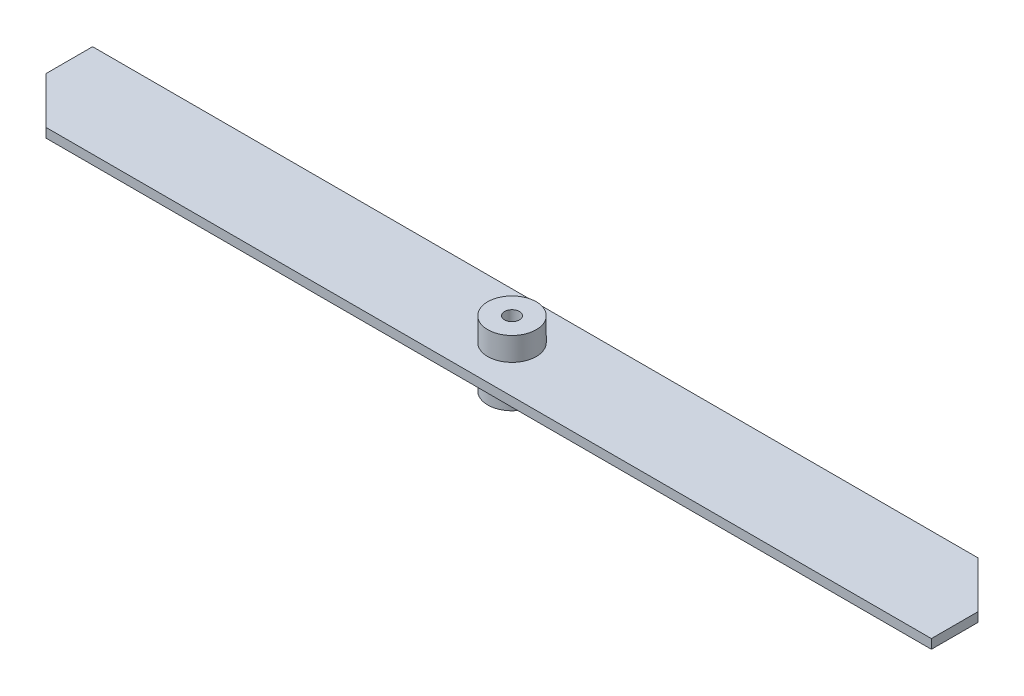
ISO-10303-21;
HEADER;
FILE_DESCRIPTION(('STEP AP214'),'2;1');
FILE_NAME('part.step','',(''),(''),'','','');
FILE_SCHEMA(('AUTOMOTIVE_DESIGN { 1 0 10303 214 1 1 1 1 }'));
ENDSEC;
DATA;
#1=APPLICATION_CONTEXT('core data for automotive mechanical design processes');
#2=APPLICATION_PROTOCOL_DEFINITION('international standard','automotive_design',2000,#1);
#3=PRODUCT_CONTEXT('',#1,'mechanical');
#4=PRODUCT('Part','Part','',(#3));
#5=PRODUCT_RELATED_PRODUCT_CATEGORY('part','',(#4));
#6=PRODUCT_DEFINITION_FORMATION('','',#4);
#7=PRODUCT_DEFINITION_CONTEXT('part definition',#1,'design');
#8=PRODUCT_DEFINITION('design','',#6,#7);
#9=PRODUCT_DEFINITION_SHAPE('','',#8);
#10=(LENGTH_UNIT() NAMED_UNIT(*) SI_UNIT(.MILLI.,.METRE.));
#11=(NAMED_UNIT(*) PLANE_ANGLE_UNIT() SI_UNIT($,.RADIAN.));
#12=(NAMED_UNIT(*) SI_UNIT($,.STERADIAN.) SOLID_ANGLE_UNIT());
#13=UNCERTAINTY_MEASURE_WITH_UNIT(LENGTH_MEASURE(1.E-05),#10,'distance_accuracy_value','');
#14=(GEOMETRIC_REPRESENTATION_CONTEXT(3) GLOBAL_UNCERTAINTY_ASSIGNED_CONTEXT((#13)) GLOBAL_UNIT_ASSIGNED_CONTEXT((#10,
#11,#12)) REPRESENTATION_CONTEXT('',''));
#15=CARTESIAN_POINT('',(0.,0.,0.));
#16=DIRECTION('',(0.,0.,1.));
#17=DIRECTION('',(1.,0.,0.));
#18=AXIS2_PLACEMENT_3D('',#15,#16,#17);
#19=CARTESIAN_POINT('',(0.,2.,0.));
#20=DIRECTION('',(0.,1.,0.));
#21=DIRECTION('',(0.,0.,1.));
#22=AXIS2_PLACEMENT_3D('',#19,#20,#21);
#23=PLANE('',#22);
#24=CARTESIAN_POINT('',(0.,2.,0.));
#25=DIRECTION('',(0.,1.,0.));
#26=DIRECTION('',(0.,0.,1.));
#27=AXIS2_PLACEMENT_3D('',#24,#25,#26);
#28=CIRCLE('',#27,5.2);
#29=CARTESIAN_POINT('',(0.,2.,5.2));
#30=VERTEX_POINT('',#29);
#31=EDGE_CURVE('E123',#30,#30,#28,.F.);
#32=ORIENTED_EDGE('',*,*,#31,.T.);
#33=EDGE_LOOP('',(#32));
#34=FACE_BOUND('',#33,.T.);
#35=DIRECTION('',(-1.,0.,0.));
#36=VECTOR('',#35,1.);
#37=CARTESIAN_POINT('',(-100.,2.,-10.));
#38=LINE('',#37,#36);
#39=CARTESIAN_POINT('',(90.,2.,-10.));
#40=VERTEX_POINT('',#39);
#41=CARTESIAN_POINT('',(-100.,2.,-10.));
#42=VERTEX_POINT('',#41);
#43=EDGE_CURVE('E130',#40,#42,#38,.T.);
#44=ORIENTED_EDGE('',*,*,#43,.T.);
#45=DIRECTION('',(0.,0.,1.));
#46=VECTOR('',#45,1.);
#47=CARTESIAN_POINT('',(-100.,2.,0.));
#48=LINE('',#47,#46);
#49=CARTESIAN_POINT('',(-100.,2.,0.));
#50=VERTEX_POINT('',#49);
#51=EDGE_CURVE('E89',#42,#50,#48,.T.);
#52=ORIENTED_EDGE('',*,*,#51,.T.);
#53=DIRECTION('',(0.707106781186547,0.,0.707106781186548));
#54=VECTOR('',#53,1.);
#55=CARTESIAN_POINT('',(-90.,2.,10.));
#56=LINE('',#55,#54);
#57=CARTESIAN_POINT('',(-90.,2.,10.));
#58=VERTEX_POINT('',#57);
#59=EDGE_CURVE('E101',#50,#58,#56,.T.);
#60=ORIENTED_EDGE('',*,*,#59,.T.);
#61=DIRECTION('',(1.,0.,0.));
#62=VECTOR('',#61,1.);
#63=CARTESIAN_POINT('',(-90.,2.,10.));
#64=LINE('',#63,#62);
#65=CARTESIAN_POINT('',(100.,2.,10.));
#66=VERTEX_POINT('',#65);
#67=EDGE_CURVE('E96',#58,#66,#64,.T.);
#68=ORIENTED_EDGE('',*,*,#67,.T.);
#69=DIRECTION('',(0.,0.,-1.));
#70=VECTOR('',#69,1.);
#71=CARTESIAN_POINT('',(100.,2.,10.));
#72=LINE('',#71,#70);
#73=CARTESIAN_POINT('',(100.,2.,0.));
#74=VERTEX_POINT('',#73);
#75=EDGE_CURVE('E99',#66,#74,#72,.T.);
#76=ORIENTED_EDGE('',*,*,#75,.T.);
#77=DIRECTION('',(-0.707106781186547,0.,-0.707106781186548));
#78=VECTOR('',#77,1.);
#79=CARTESIAN_POINT('',(90.,2.,-10.));
#80=LINE('',#79,#78);
#81=EDGE_CURVE('E51',#74,#40,#80,.T.);
#82=ORIENTED_EDGE('',*,*,#81,.T.);
#83=EDGE_LOOP('',(#44,#52,#60,#68,#76,#82));
#84=FACE_BOUND('',#83,.T.);
#85=ADVANCED_FACE('F34',(#34,#84),#23,.T.);
#86=CARTESIAN_POINT('',(0.,0.,0.));
#87=DIRECTION('',(0.,1.,0.));
#88=DIRECTION('',(0.,0.,1.));
#89=AXIS2_PLACEMENT_3D('',#86,#87,#88);
#90=PLANE('',#89);
#91=CARTESIAN_POINT('',(0.,0.,0.));
#92=DIRECTION('',(0.,1.,0.));
#93=DIRECTION('',(0.,0.,1.));
#94=AXIS2_PLACEMENT_3D('',#91,#92,#93);
#95=CIRCLE('',#94,5.2);
#96=CARTESIAN_POINT('',(0.,0.,5.2));
#97=VERTEX_POINT('',#96);
#98=EDGE_CURVE('E11',#97,#97,#95,.F.);
#99=ORIENTED_EDGE('',*,*,#98,.F.);
#100=EDGE_LOOP('',(#99));
#101=FACE_BOUND('',#100,.T.);
#102=DIRECTION('',(-1.,0.,0.));
#103=VECTOR('',#102,1.);
#104=CARTESIAN_POINT('',(-100.,0.,-10.));
#105=LINE('',#104,#103);
#106=CARTESIAN_POINT('',(90.,0.,-10.));
#107=VERTEX_POINT('',#106);
#108=CARTESIAN_POINT('',(-100.,0.,-10.));
#109=VERTEX_POINT('',#108);
#110=EDGE_CURVE('E119',#107,#109,#105,.T.);
#111=ORIENTED_EDGE('',*,*,#110,.F.);
#112=DIRECTION('',(-0.707106781186547,0.,-0.707106781186548));
#113=VECTOR('',#112,1.);
#114=CARTESIAN_POINT('',(90.,0.,-10.));
#115=LINE('',#114,#113);
#116=CARTESIAN_POINT('',(100.,0.,0.));
#117=VERTEX_POINT('',#116);
#118=EDGE_CURVE('E80',#117,#107,#115,.T.);
#119=ORIENTED_EDGE('',*,*,#118,.F.);
#120=DIRECTION('',(0.,0.,-1.));
#121=VECTOR('',#120,1.);
#122=CARTESIAN_POINT('',(100.,0.,10.));
#123=LINE('',#122,#121);
#124=CARTESIAN_POINT('',(100.,0.,10.));
#125=VERTEX_POINT('',#124);
#126=EDGE_CURVE('E74',#125,#117,#123,.T.);
#127=ORIENTED_EDGE('',*,*,#126,.F.);
#128=DIRECTION('',(1.,0.,0.));
#129=VECTOR('',#128,1.);
#130=CARTESIAN_POINT('',(-90.,0.,10.));
#131=LINE('',#130,#129);
#132=CARTESIAN_POINT('',(-90.,0.,10.));
#133=VERTEX_POINT('',#132);
#134=EDGE_CURVE('E109',#133,#125,#131,.T.);
#135=ORIENTED_EDGE('',*,*,#134,.F.);
#136=DIRECTION('',(0.707106781186547,0.,0.707106781186548));
#137=VECTOR('',#136,1.);
#138=CARTESIAN_POINT('',(-90.,0.,10.));
#139=LINE('',#138,#137);
#140=CARTESIAN_POINT('',(-100.,0.,0.));
#141=VERTEX_POINT('',#140);
#142=EDGE_CURVE('E125',#141,#133,#139,.T.);
#143=ORIENTED_EDGE('',*,*,#142,.F.);
#144=DIRECTION('',(0.,0.,1.));
#145=VECTOR('',#144,1.);
#146=CARTESIAN_POINT('',(-100.,0.,0.));
#147=LINE('',#146,#145);
#148=EDGE_CURVE('E122',#109,#141,#147,.T.);
#149=ORIENTED_EDGE('',*,*,#148,.F.);
#150=EDGE_LOOP('',(#111,#119,#127,#135,#143,#149));
#151=FACE_BOUND('',#150,.T.);
#152=ADVANCED_FACE('F142',(#101,#151),#90,.F.);
#153=CARTESIAN_POINT('',(-100.,2.,-10.));
#154=DIRECTION('',(0.,0.,1.));
#155=DIRECTION('',(1.,0.,0.));
#156=AXIS2_PLACEMENT_3D('',#153,#154,#155);
#157=PLANE('',#156);
#158=ORIENTED_EDGE('',*,*,#110,.T.);
#159=DIRECTION('',(0.,-1.,0.));
#160=VECTOR('',#159,1.);
#161=CARTESIAN_POINT('',(-100.,2.,-10.));
#162=LINE('',#161,#160);
#163=EDGE_CURVE('E43',#42,#109,#162,.T.);
#164=ORIENTED_EDGE('',*,*,#163,.F.);
#165=ORIENTED_EDGE('',*,*,#43,.F.);
#166=DIRECTION('',(0.,-1.,0.));
#167=VECTOR('',#166,1.);
#168=CARTESIAN_POINT('',(90.,2.,-10.));
#169=LINE('',#168,#167);
#170=EDGE_CURVE('E115',#40,#107,#169,.T.);
#171=ORIENTED_EDGE('',*,*,#170,.T.);
#172=EDGE_LOOP('',(#158,#164,#165,#171));
#173=FACE_BOUND('',#172,.T.);
#174=ADVANCED_FACE('F36',(#173),#157,.F.);
#175=CARTESIAN_POINT('',(-100.,2.,0.));
#176=DIRECTION('',(1.,0.,0.));
#177=DIRECTION('',(0.,0.,-1.));
#178=AXIS2_PLACEMENT_3D('',#175,#176,#177);
#179=PLANE('',#178);
#180=ORIENTED_EDGE('',*,*,#148,.T.);
#181=DIRECTION('',(0.,-1.,0.));
#182=VECTOR('',#181,1.);
#183=CARTESIAN_POINT('',(-100.,2.,0.));
#184=LINE('',#183,#182);
#185=EDGE_CURVE('E134',#50,#141,#184,.T.);
#186=ORIENTED_EDGE('',*,*,#185,.F.);
#187=ORIENTED_EDGE('',*,*,#51,.F.);
#188=ORIENTED_EDGE('',*,*,#163,.T.);
#189=EDGE_LOOP('',(#180,#186,#187,#188));
#190=FACE_BOUND('',#189,.T.);
#191=ADVANCED_FACE('F137',(#190),#179,.F.);
#192=CARTESIAN_POINT('',(-90.,2.,10.));
#193=DIRECTION('',(0.707106781186548,0.,-0.707106781186547));
#194=DIRECTION('',(-0.707106781186547,0.,-0.707106781186548));
#195=AXIS2_PLACEMENT_3D('',#192,#193,#194);
#196=PLANE('',#195);
#197=ORIENTED_EDGE('',*,*,#142,.T.);
#198=DIRECTION('',(0.,-1.,0.));
#199=VECTOR('',#198,1.);
#200=CARTESIAN_POINT('',(-90.,2.,10.));
#201=LINE('',#200,#199);
#202=EDGE_CURVE('E110',#58,#133,#201,.T.);
#203=ORIENTED_EDGE('',*,*,#202,.F.);
#204=ORIENTED_EDGE('',*,*,#59,.F.);
#205=ORIENTED_EDGE('',*,*,#185,.T.);
#206=EDGE_LOOP('',(#197,#203,#204,#205));
#207=FACE_BOUND('',#206,.T.);
#208=ADVANCED_FACE('F145',(#207),#196,.F.);
#209=CARTESIAN_POINT('',(-90.,2.,10.));
#210=DIRECTION('',(0.,0.,-1.));
#211=DIRECTION('',(-1.,0.,0.));
#212=AXIS2_PLACEMENT_3D('',#209,#210,#211);
#213=PLANE('',#212);
#214=ORIENTED_EDGE('',*,*,#134,.T.);
#215=DIRECTION('',(0.,-1.,0.));
#216=VECTOR('',#215,1.);
#217=CARTESIAN_POINT('',(100.,2.,10.));
#218=LINE('',#217,#216);
#219=EDGE_CURVE('E106',#66,#125,#218,.T.);
#220=ORIENTED_EDGE('',*,*,#219,.F.);
#221=ORIENTED_EDGE('',*,*,#67,.F.);
#222=ORIENTED_EDGE('',*,*,#202,.T.);
#223=EDGE_LOOP('',(#214,#220,#221,#222));
#224=FACE_BOUND('',#223,.T.);
#225=ADVANCED_FACE('F107',(#224),#213,.F.);
#226=CARTESIAN_POINT('',(100.,2.,10.));
#227=DIRECTION('',(-1.,0.,0.));
#228=DIRECTION('',(0.,0.,1.));
#229=AXIS2_PLACEMENT_3D('',#226,#227,#228);
#230=PLANE('',#229);
#231=ORIENTED_EDGE('',*,*,#126,.T.);
#232=DIRECTION('',(0.,-1.,0.));
#233=VECTOR('',#232,1.);
#234=CARTESIAN_POINT('',(100.,2.,0.));
#235=LINE('',#234,#233);
#236=EDGE_CURVE('E111',#74,#117,#235,.T.);
#237=ORIENTED_EDGE('',*,*,#236,.F.);
#238=ORIENTED_EDGE('',*,*,#75,.F.);
#239=ORIENTED_EDGE('',*,*,#219,.T.);
#240=EDGE_LOOP('',(#231,#237,#238,#239));
#241=FACE_BOUND('',#240,.T.);
#242=ADVANCED_FACE('F113',(#241),#230,.F.);
#243=CARTESIAN_POINT('',(90.,2.,-10.));
#244=DIRECTION('',(-0.707106781186548,0.,0.707106781186547));
#245=DIRECTION('',(0.707106781186547,0.,0.707106781186548));
#246=AXIS2_PLACEMENT_3D('',#243,#244,#245);
#247=PLANE('',#246);
#248=ORIENTED_EDGE('',*,*,#118,.T.);
#249=ORIENTED_EDGE('',*,*,#170,.F.);
#250=ORIENTED_EDGE('',*,*,#81,.F.);
#251=ORIENTED_EDGE('',*,*,#236,.T.);
#252=EDGE_LOOP('',(#248,#249,#250,#251));
#253=FACE_BOUND('',#252,.T.);
#254=ADVANCED_FACE('F198',(#253),#247,.F.);
#255=CARTESIAN_POINT('',(0.,-7.,0.));
#256=DIRECTION('',(0.,-1.,0.));
#257=DIRECTION('',(0.,0.,-1.));
#258=AXIS2_PLACEMENT_3D('',#255,#256,#257);
#259=PLANE('',#258);
#260=CARTESIAN_POINT('',(0.,-7.,0.));
#261=DIRECTION('',(0.,-1.,0.));
#262=DIRECTION('',(0.,0.,-1.));
#263=AXIS2_PLACEMENT_3D('',#260,#261,#262);
#264=CIRCLE('',#263,5.2);
#265=CARTESIAN_POINT('',(0.,-7.,-5.2));
#266=VERTEX_POINT('',#265);
#267=EDGE_CURVE('E151',#266,#266,#264,.T.);
#268=ORIENTED_EDGE('',*,*,#267,.T.);
#269=EDGE_LOOP('',(#268));
#270=FACE_BOUND('',#269,.T.);
#271=ADVANCED_FACE('F186',(#270),#259,.T.);
#272=CARTESIAN_POINT('',(0.,-7.,0.));
#273=DIRECTION('',(0.,1.,0.));
#274=DIRECTION('',(0.,0.,1.));
#275=AXIS2_PLACEMENT_3D('',#272,#273,#274);
#276=CYLINDRICAL_SURFACE('',#275,5.2);
#277=ORIENTED_EDGE('',*,*,#267,.F.);
#278=EDGE_LOOP('',(#277));
#279=FACE_BOUND('',#278,.T.);
#280=ORIENTED_EDGE('',*,*,#98,.T.);
#281=EDGE_LOOP('',(#280));
#282=FACE_BOUND('',#281,.T.);
#283=ADVANCED_FACE('F180',(#279,#282),#276,.T.);
#284=ORIENTED_EDGE('',*,*,#31,.F.);
#285=EDGE_LOOP('',(#284));
#286=FACE_BOUND('',#285,.T.);
#287=CARTESIAN_POINT('',(0.,7.,0.));
#288=DIRECTION('',(0.,-1.,0.));
#289=DIRECTION('',(0.,0.,-1.));
#290=AXIS2_PLACEMENT_3D('',#287,#288,#289);
#291=CIRCLE('',#290,5.2);
#292=CARTESIAN_POINT('',(0.,7.,-5.2));
#293=VERTEX_POINT('',#292);
#294=EDGE_CURVE('E152',#293,#293,#291,.T.);
#295=ORIENTED_EDGE('',*,*,#294,.T.);
#296=EDGE_LOOP('',(#295));
#297=FACE_BOUND('',#296,.T.);
#298=ADVANCED_FACE('F175',(#286,#297),#276,.T.);
#299=CARTESIAN_POINT('',(0.,7.,0.));
#300=DIRECTION('',(0.,-1.,0.));
#301=DIRECTION('',(0.,0.,-1.));
#302=AXIS2_PLACEMENT_3D('',#299,#300,#301);
#303=PLANE('',#302);
#304=CARTESIAN_POINT('',(0.,7.,0.));
#305=DIRECTION('',(0.,1.,0.));
#306=DIRECTION('',(0.,0.,1.));
#307=AXIS2_PLACEMENT_3D('',#304,#305,#306);
#308=CIRCLE('',#307,1.585);
#309=CARTESIAN_POINT('',(0.,7.,1.585));
#310=VERTEX_POINT('',#309);
#311=EDGE_CURVE('E158',#310,#310,#308,.T.);
#312=ORIENTED_EDGE('',*,*,#311,.F.);
#313=EDGE_LOOP('',(#312));
#314=FACE_BOUND('',#313,.T.);
#315=ORIENTED_EDGE('',*,*,#294,.F.);
#316=EDGE_LOOP('',(#315));
#317=FACE_BOUND('',#316,.T.);
#318=ADVANCED_FACE('F169',(#314,#317),#303,.F.);
#319=CARTESIAN_POINT('',(0.,-3.,0.));
#320=DIRECTION('',(0.,1.,0.));
#321=DIRECTION('',(0.,0.,1.));
#322=AXIS2_PLACEMENT_3D('',#319,#320,#321);
#323=CYLINDRICAL_SURFACE('',#322,1.585);
#324=CARTESIAN_POINT('',(0.,-3.,0.));
#325=DIRECTION('',(0.,1.,0.));
#326=DIRECTION('',(0.,0.,1.));
#327=AXIS2_PLACEMENT_3D('',#324,#325,#326);
#328=CIRCLE('',#327,1.585);
#329=CARTESIAN_POINT('',(0.,-3.,1.585));
#330=VERTEX_POINT('',#329);
#331=EDGE_CURVE('E155',#330,#330,#328,.T.);
#332=ORIENTED_EDGE('',*,*,#331,.F.);
#333=EDGE_LOOP('',(#332));
#334=FACE_BOUND('',#333,.T.);
#335=ORIENTED_EDGE('',*,*,#311,.T.);
#336=EDGE_LOOP('',(#335));
#337=FACE_BOUND('',#336,.T.);
#338=ADVANCED_FACE('F166',(#334,#337),#323,.F.);
#339=CARTESIAN_POINT('',(0.,-3.,0.));
#340=DIRECTION('',(0.,1.,0.));
#341=DIRECTION('',(0.,0.,1.));
#342=AXIS2_PLACEMENT_3D('',#339,#340,#341);
#343=PLANE('',#342);
#344=ORIENTED_EDGE('',*,*,#331,.T.);
#345=EDGE_LOOP('',(#344));
#346=FACE_BOUND('',#345,.T.);
#347=ADVANCED_FACE('F164',(#346),#343,.T.);
#348=CLOSED_SHELL('',(#85,#152,#174,#191,#208,#225,#242,#254,#271,#283,#298,#318,#338,#347));
#349=MANIFOLD_SOLID_BREP('B2',#348);
#350=ADVANCED_BREP_SHAPE_REPRESENTATION('',(#18,#349),#14);
#351=SHAPE_DEFINITION_REPRESENTATION(#9,#350);
ENDSEC;
END-ISO-10303-21;
